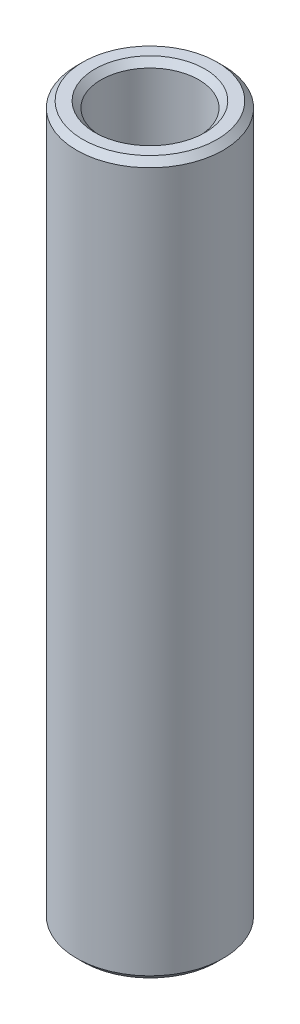
ISO-10303-21;
HEADER;
FILE_DESCRIPTION(('STEP AP214'),'2;1');
FILE_NAME('part.step','',(''),(''),'','','');
FILE_SCHEMA(('AUTOMOTIVE_DESIGN { 1 0 10303 214 1 1 1 1 }'));
ENDSEC;
DATA;
#1=APPLICATION_CONTEXT('core data for automotive mechanical design processes');
#2=APPLICATION_PROTOCOL_DEFINITION('international standard','automotive_design',2000,#1);
#3=PRODUCT_CONTEXT('',#1,'mechanical');
#4=PRODUCT('Part','Part','',(#3));
#5=PRODUCT_RELATED_PRODUCT_CATEGORY('part','',(#4));
#6=PRODUCT_DEFINITION_FORMATION('','',#4);
#7=PRODUCT_DEFINITION_CONTEXT('part definition',#1,'design');
#8=PRODUCT_DEFINITION('design','',#6,#7);
#9=PRODUCT_DEFINITION_SHAPE('','',#8);
#10=(LENGTH_UNIT() NAMED_UNIT(*) SI_UNIT(.MILLI.,.METRE.));
#11=(NAMED_UNIT(*) PLANE_ANGLE_UNIT() SI_UNIT($,.RADIAN.));
#12=(NAMED_UNIT(*) SI_UNIT($,.STERADIAN.) SOLID_ANGLE_UNIT());
#13=UNCERTAINTY_MEASURE_WITH_UNIT(LENGTH_MEASURE(1.E-05),#10,'distance_accuracy_value','');
#14=(GEOMETRIC_REPRESENTATION_CONTEXT(3) GLOBAL_UNCERTAINTY_ASSIGNED_CONTEXT((#13)) GLOBAL_UNIT_ASSIGNED_CONTEXT((#10,
#11,#12)) REPRESENTATION_CONTEXT('',''));
#15=CARTESIAN_POINT('',(0.,0.,0.));
#16=DIRECTION('',(0.,0.,1.));
#17=DIRECTION('',(1.,0.,0.));
#18=AXIS2_PLACEMENT_3D('',#15,#16,#17);
#19=CARTESIAN_POINT('',(3.,14.57325,0.));
#20=DIRECTION('',(0.,-1.,0.));
#21=DIRECTION('',(1.,0.,0.));
#22=AXIS2_PLACEMENT_3D('',#19,#20,#21);
#23=PLANE('',#22);
#24=CARTESIAN_POINT('',(0.,14.57325,0.));
#25=DIRECTION('',(0.,-1.,0.));
#26=DIRECTION('',(1.,0.,0.));
#27=AXIS2_PLACEMENT_3D('',#24,#25,#26);
#28=CIRCLE('',#27,2.746);
#29=CARTESIAN_POINT('',(2.74600000000001,14.57325,0.));
#30=VERTEX_POINT('',#29);
#31=EDGE_CURVE('E10',#30,#30,#28,.F.);
#32=ORIENTED_EDGE('',*,*,#31,.T.);
#33=EDGE_LOOP('',(#32));
#34=FACE_BOUND('',#33,.T.);
#35=CARTESIAN_POINT('',(0.,14.57325,0.));
#36=DIRECTION('',(0.,-1.,0.));
#37=DIRECTION('',(1.,0.,0.));
#38=AXIS2_PLACEMENT_3D('',#35,#36,#37);
#39=CIRCLE('',#38,2.254);
#40=CARTESIAN_POINT('',(2.254,14.57325,0.));
#41=VERTEX_POINT('',#40);
#42=EDGE_CURVE('E37',#41,#41,#39,.T.);
#43=ORIENTED_EDGE('',*,*,#42,.T.);
#44=EDGE_LOOP('',(#43));
#45=FACE_BOUND('',#44,.T.);
#46=ADVANCED_FACE('F30',(#34,#45),#23,.F.);
#47=CARTESIAN_POINT('',(0.,9.96165346252002,0.));
#48=DIRECTION('',(0.,1.,0.));
#49=DIRECTION('',(-1.,0.,0.));
#50=AXIS2_PLACEMENT_3D('',#47,#48,#49);
#51=CYLINDRICAL_SURFACE('',#50,2.);
#52=CARTESIAN_POINT('',(0.,-14.31925,0.));
#53=DIRECTION('',(0.,1.,0.));
#54=DIRECTION('',(-1.,0.,0.));
#55=AXIS2_PLACEMENT_3D('',#52,#53,#54);
#56=CIRCLE('',#55,2.);
#57=CARTESIAN_POINT('',(-2.,-14.31925,0.));
#58=VERTEX_POINT('',#57);
#59=EDGE_CURVE('E50',#58,#58,#56,.F.);
#60=ORIENTED_EDGE('',*,*,#59,.T.);
#61=EDGE_LOOP('',(#60));
#62=FACE_BOUND('',#61,.T.);
#63=CARTESIAN_POINT('',(0.,14.31925,0.));
#64=DIRECTION('',(0.,-1.,0.));
#65=DIRECTION('',(1.,0.,0.));
#66=AXIS2_PLACEMENT_3D('',#63,#64,#65);
#67=CIRCLE('',#66,2.);
#68=CARTESIAN_POINT('',(2.00000000000001,14.31925,0.));
#69=VERTEX_POINT('',#68);
#70=EDGE_CURVE('E53',#69,#69,#67,.F.);
#71=ORIENTED_EDGE('',*,*,#70,.T.);
#72=EDGE_LOOP('',(#71));
#73=FACE_BOUND('',#72,.T.);
#74=ADVANCED_FACE('F86',(#62,#73),#51,.F.);
#75=CARTESIAN_POINT('',(2.,-14.57325,0.));
#76=DIRECTION('',(0.,1.,0.));
#77=DIRECTION('',(-1.,0.,0.));
#78=AXIS2_PLACEMENT_3D('',#75,#76,#77);
#79=PLANE('',#78);
#80=CARTESIAN_POINT('',(0.,-14.57325,0.));
#81=DIRECTION('',(0.,1.,0.));
#82=DIRECTION('',(-1.,0.,0.));
#83=AXIS2_PLACEMENT_3D('',#80,#81,#82);
#84=CIRCLE('',#83,2.254);
#85=CARTESIAN_POINT('',(-2.254,-14.57325,0.));
#86=VERTEX_POINT('',#85);
#87=EDGE_CURVE('E56',#86,#86,#84,.T.);
#88=ORIENTED_EDGE('',*,*,#87,.T.);
#89=EDGE_LOOP('',(#88));
#90=FACE_BOUND('',#89,.T.);
#91=CARTESIAN_POINT('',(0.,-14.57325,0.));
#92=DIRECTION('',(0.,1.,0.));
#93=DIRECTION('',(-1.,0.,0.));
#94=AXIS2_PLACEMENT_3D('',#91,#92,#93);
#95=CIRCLE('',#94,2.746);
#96=CARTESIAN_POINT('',(-2.746,-14.57325,0.));
#97=VERTEX_POINT('',#96);
#98=EDGE_CURVE('E59',#97,#97,#95,.F.);
#99=ORIENTED_EDGE('',*,*,#98,.T.);
#100=EDGE_LOOP('',(#99));
#101=FACE_BOUND('',#100,.T.);
#102=ADVANCED_FACE('F63',(#90,#101),#79,.F.);
#103=CARTESIAN_POINT('',(0.,9.96165346252002,0.));
#104=DIRECTION('',(0.,1.,0.));
#105=DIRECTION('',(-1.,0.,0.));
#106=AXIS2_PLACEMENT_3D('',#103,#104,#105);
#107=CYLINDRICAL_SURFACE('',#106,3.);
#108=CARTESIAN_POINT('',(0.,-14.31925,0.));
#109=DIRECTION('',(0.,1.,0.));
#110=DIRECTION('',(-1.,0.,0.));
#111=AXIS2_PLACEMENT_3D('',#108,#109,#110);
#112=CIRCLE('',#111,3.);
#113=CARTESIAN_POINT('',(-3.,-14.31925,0.));
#114=VERTEX_POINT('',#113);
#115=EDGE_CURVE('E41',#114,#114,#112,.T.);
#116=ORIENTED_EDGE('',*,*,#115,.T.);
#117=EDGE_LOOP('',(#116));
#118=FACE_BOUND('',#117,.T.);
#119=CARTESIAN_POINT('',(0.,14.31925,0.));
#120=DIRECTION('',(0.,-1.,0.));
#121=DIRECTION('',(1.,0.,0.));
#122=AXIS2_PLACEMENT_3D('',#119,#120,#121);
#123=CIRCLE('',#122,3.);
#124=CARTESIAN_POINT('',(3.00000000000001,14.31925,0.));
#125=VERTEX_POINT('',#124);
#126=EDGE_CURVE('E45',#125,#125,#123,.T.);
#127=ORIENTED_EDGE('',*,*,#126,.T.);
#128=EDGE_LOOP('',(#127));
#129=FACE_BOUND('',#128,.T.);
#130=ADVANCED_FACE('F73',(#118,#129),#107,.T.);
#131=CARTESIAN_POINT('',(0.,-14.57325,0.));
#132=DIRECTION('',(0.,-1.,0.));
#133=DIRECTION('',(1.,0.,0.));
#134=AXIS2_PLACEMENT_3D('',#131,#132,#133);
#135=CONICAL_SURFACE('',#134,2.254,0.785398163397441);
#136=ORIENTED_EDGE('',*,*,#59,.F.);
#137=EDGE_LOOP('',(#136));
#138=FACE_BOUND('',#137,.T.);
#139=ORIENTED_EDGE('',*,*,#87,.F.);
#140=EDGE_LOOP('',(#139));
#141=FACE_BOUND('',#140,.T.);
#142=ADVANCED_FACE('F69',(#138,#141),#135,.F.);
#143=CARTESIAN_POINT('',(0.,-14.31925,0.));
#144=DIRECTION('',(0.,1.,0.));
#145=DIRECTION('',(-1.,0.,0.));
#146=AXIS2_PLACEMENT_3D('',#143,#144,#145);
#147=CONICAL_SURFACE('',#146,3.,0.785398163397454);
#148=ORIENTED_EDGE('',*,*,#98,.F.);
#149=EDGE_LOOP('',(#148));
#150=FACE_BOUND('',#149,.T.);
#151=ORIENTED_EDGE('',*,*,#115,.F.);
#152=EDGE_LOOP('',(#151));
#153=FACE_BOUND('',#152,.T.);
#154=ADVANCED_FACE('F65',(#150,#153),#147,.T.);
#155=CARTESIAN_POINT('',(0.,14.57325,0.));
#156=DIRECTION('',(0.,-1.,0.));
#157=DIRECTION('',(1.,0.,0.));
#158=AXIS2_PLACEMENT_3D('',#155,#156,#157);
#159=CONICAL_SURFACE('',#158,2.746,0.785398163397441);
#160=ORIENTED_EDGE('',*,*,#126,.F.);
#161=EDGE_LOOP('',(#160));
#162=FACE_BOUND('',#161,.T.);
#163=ORIENTED_EDGE('',*,*,#31,.F.);
#164=EDGE_LOOP('',(#163));
#165=FACE_BOUND('',#164,.T.);
#166=ADVANCED_FACE('F68',(#162,#165),#159,.T.);
#167=CARTESIAN_POINT('',(0.,14.31925,0.));
#168=DIRECTION('',(0.,1.,0.));
#169=DIRECTION('',(-1.,0.,0.));
#170=AXIS2_PLACEMENT_3D('',#167,#168,#169);
#171=CONICAL_SURFACE('',#170,2.,0.785398163397451);
#172=ORIENTED_EDGE('',*,*,#42,.F.);
#173=EDGE_LOOP('',(#172));
#174=FACE_BOUND('',#173,.T.);
#175=ORIENTED_EDGE('',*,*,#70,.F.);
#176=EDGE_LOOP('',(#175));
#177=FACE_BOUND('',#176,.T.);
#178=ADVANCED_FACE('F32',(#174,#177),#171,.F.);
#179=CLOSED_SHELL('',(#46,#74,#102,#130,#142,#154,#166,#178));
#180=MANIFOLD_SOLID_BREP('B2',#179);
#181=ADVANCED_BREP_SHAPE_REPRESENTATION('',(#18,#180),#14);
#182=SHAPE_DEFINITION_REPRESENTATION(#9,#181);
ENDSEC;
END-ISO-10303-21;
